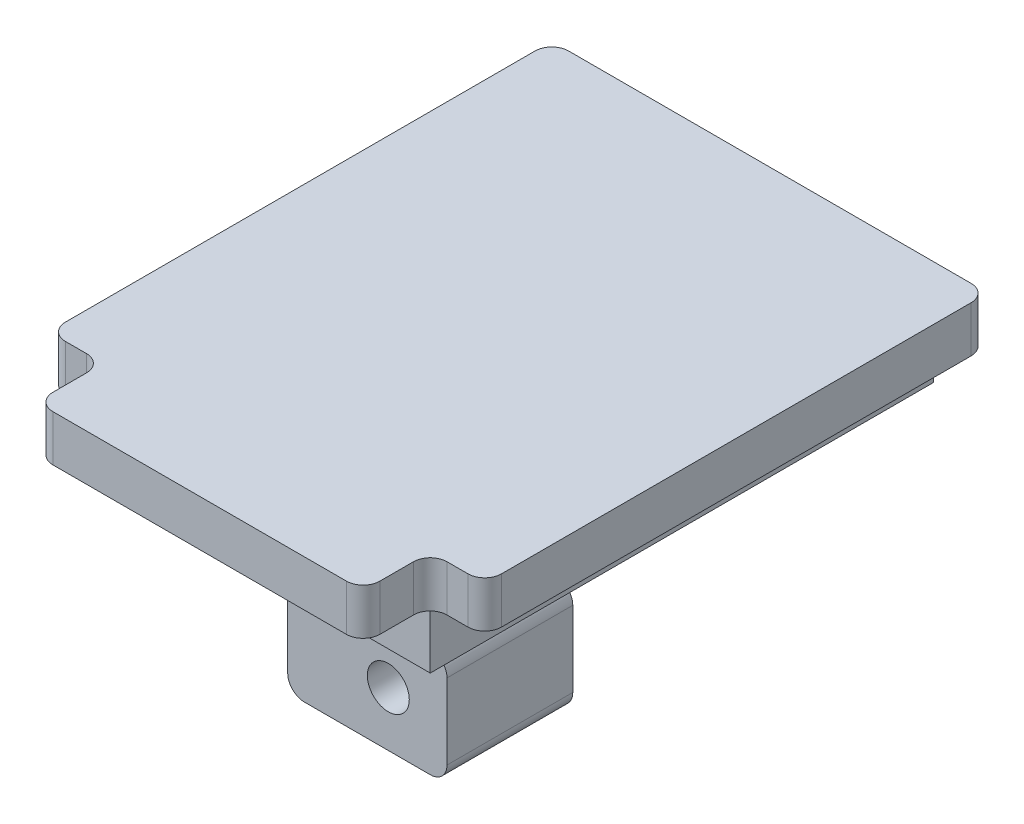
ISO-10303-21;
HEADER;
FILE_DESCRIPTION(('STEP AP214'),'2;1');
FILE_NAME('part.step','',(''),(''),'','','');
FILE_SCHEMA(('AUTOMOTIVE_DESIGN { 1 0 10303 214 1 1 1 1 }'));
ENDSEC;
DATA;
#1=APPLICATION_CONTEXT('core data for automotive mechanical design processes');
#2=APPLICATION_PROTOCOL_DEFINITION('international standard','automotive_design',2000,#1);
#3=PRODUCT_CONTEXT('',#1,'mechanical');
#4=PRODUCT('Part','Part','',(#3));
#5=PRODUCT_RELATED_PRODUCT_CATEGORY('part','',(#4));
#6=PRODUCT_DEFINITION_FORMATION('','',#4);
#7=PRODUCT_DEFINITION_CONTEXT('part definition',#1,'design');
#8=PRODUCT_DEFINITION('design','',#6,#7);
#9=PRODUCT_DEFINITION_SHAPE('','',#8);
#10=(LENGTH_UNIT() NAMED_UNIT(*) SI_UNIT(.MILLI.,.METRE.));
#11=(NAMED_UNIT(*) PLANE_ANGLE_UNIT() SI_UNIT($,.RADIAN.));
#12=(NAMED_UNIT(*) SI_UNIT($,.STERADIAN.) SOLID_ANGLE_UNIT());
#13=UNCERTAINTY_MEASURE_WITH_UNIT(LENGTH_MEASURE(1.E-05),#10,'distance_accuracy_value','');
#14=(GEOMETRIC_REPRESENTATION_CONTEXT(3) GLOBAL_UNCERTAINTY_ASSIGNED_CONTEXT((#13)) GLOBAL_UNIT_ASSIGNED_CONTEXT((#10,
#11,#12)) REPRESENTATION_CONTEXT('',''));
#15=CARTESIAN_POINT('',(0.,0.,0.));
#16=DIRECTION('',(0.,0.,1.));
#17=DIRECTION('',(1.,0.,0.));
#18=AXIS2_PLACEMENT_3D('',#15,#16,#17);
#19=CARTESIAN_POINT('',(19.5,-12.5,60.));
#20=DIRECTION('',(0.,1.,0.));
#21=DIRECTION('',(-1.,0.,0.));
#22=AXIS2_PLACEMENT_3D('',#19,#20,#21);
#23=PLANE('',#22);
#24=DIRECTION('',(1.,0.,0.));
#25=VECTOR('',#24,1.);
#26=CARTESIAN_POINT('',(19.5,-12.5,0.));
#27=LINE('',#26,#25);
#28=CARTESIAN_POINT('',(-19.5,-12.5,0.));
#29=VERTEX_POINT('',#28);
#30=CARTESIAN_POINT('',(19.5,-12.5,0.));
#31=VERTEX_POINT('',#30);
#32=EDGE_CURVE('E310',#29,#31,#27,.T.);
#33=ORIENTED_EDGE('',*,*,#32,.T.);
#34=DIRECTION('',(0.,0.,-1.));
#35=VECTOR('',#34,1.);
#36=CARTESIAN_POINT('',(19.5,-12.5,60.));
#37=LINE('',#36,#35);
#38=CARTESIAN_POINT('',(19.5,-12.5,60.));
#39=VERTEX_POINT('',#38);
#40=EDGE_CURVE('E323',#39,#31,#37,.T.);
#41=ORIENTED_EDGE('',*,*,#40,.F.);
#42=DIRECTION('',(1.,0.,0.));
#43=VECTOR('',#42,1.);
#44=CARTESIAN_POINT('',(19.5,-12.5,60.));
#45=LINE('',#44,#43);
#46=CARTESIAN_POINT('',(-19.5,-12.5,60.));
#47=VERTEX_POINT('',#46);
#48=EDGE_CURVE('E321',#47,#39,#45,.T.);
#49=ORIENTED_EDGE('',*,*,#48,.F.);
#50=DIRECTION('',(0.,0.,-1.));
#51=VECTOR('',#50,1.);
#52=CARTESIAN_POINT('',(-19.5,-12.5,60.));
#53=LINE('',#52,#51);
#54=EDGE_CURVE('E339',#47,#29,#53,.T.);
#55=ORIENTED_EDGE('',*,*,#54,.T.);
#56=EDGE_LOOP('',(#33,#41,#49,#55));
#57=FACE_BOUND('',#56,.T.);
#58=DIRECTION('',(0.,0.,1.));
#59=VECTOR('',#58,1.);
#60=CARTESIAN_POINT('',(3.,-12.5,45.5));
#61=LINE('',#60,#59);
#62=CARTESIAN_POINT('',(3.,-12.5,30.5));
#63=VERTEX_POINT('',#62);
#64=CARTESIAN_POINT('',(3.,-12.5,45.5));
#65=VERTEX_POINT('',#64);
#66=EDGE_CURVE('E274',#63,#65,#61,.T.);
#67=ORIENTED_EDGE('',*,*,#66,.F.);
#68=DIRECTION('',(1.,0.,0.));
#69=VECTOR('',#68,1.);
#70=CARTESIAN_POINT('',(-3.,-12.5,30.5));
#71=LINE('',#70,#69);
#72=CARTESIAN_POINT('',(-3.,-12.5,30.5));
#73=VERTEX_POINT('',#72);
#74=EDGE_CURVE('E269',#73,#63,#71,.T.);
#75=ORIENTED_EDGE('',*,*,#74,.F.);
#76=DIRECTION('',(0.,0.,-1.));
#77=VECTOR('',#76,1.);
#78=CARTESIAN_POINT('',(-3.,-12.5,45.5));
#79=LINE('',#78,#77);
#80=CARTESIAN_POINT('',(-3.,-12.5,45.5));
#81=VERTEX_POINT('',#80);
#82=EDGE_CURVE('E254',#81,#73,#79,.T.);
#83=ORIENTED_EDGE('',*,*,#82,.F.);
#84=DIRECTION('',(-1.,0.,0.));
#85=VECTOR('',#84,1.);
#86=CARTESIAN_POINT('',(-3.,-12.5,45.5));
#87=LINE('',#86,#85);
#88=EDGE_CURVE('E266',#65,#81,#87,.T.);
#89=ORIENTED_EDGE('',*,*,#88,.F.);
#90=EDGE_LOOP('',(#67,#75,#83,#89));
#91=FACE_BOUND('',#90,.T.);
#92=ADVANCED_FACE('F36',(#57,#91),#23,.F.);
#93=CARTESIAN_POINT('',(0.,0.,60.));
#94=DIRECTION('',(0.,0.,-1.));
#95=DIRECTION('',(-1.,0.,0.));
#96=AXIS2_PLACEMENT_3D('',#93,#94,#95);
#97=PLANE('',#96);
#98=DIRECTION('',(-1.,0.,0.));
#99=VECTOR('',#98,1.);
#100=CARTESIAN_POINT('',(-26.,0.,60.));
#101=LINE('',#100,#99);
#102=CARTESIAN_POINT('',(-21.5,0.,60.));
#103=VERTEX_POINT('',#102);
#104=CARTESIAN_POINT('',(-24.,0.,60.));
#105=VERTEX_POINT('',#104);
#106=EDGE_CURVE('E313',#103,#105,#101,.T.);
#107=ORIENTED_EDGE('',*,*,#106,.T.);
#108=DIRECTION('',(0.,-1.,0.));
#109=VECTOR('',#108,1.);
#110=CARTESIAN_POINT('',(-24.,0.,60.));
#111=LINE('',#110,#109);
#112=CARTESIAN_POINT('',(-24.,-5.5,60.));
#113=VERTEX_POINT('',#112);
#114=EDGE_CURVE('E396',#105,#113,#111,.T.);
#115=ORIENTED_EDGE('',*,*,#114,.T.);
#116=DIRECTION('',(1.,0.,0.));
#117=VECTOR('',#116,1.);
#118=CARTESIAN_POINT('',(-19.5,-5.5,60.));
#119=LINE('',#118,#117);
#120=CARTESIAN_POINT('',(-21.5,-5.5,60.));
#121=VERTEX_POINT('',#120);
#122=EDGE_CURVE('E317',#113,#121,#119,.T.);
#123=ORIENTED_EDGE('',*,*,#122,.T.);
#124=DIRECTION('',(0.,-1.,0.));
#125=VECTOR('',#124,1.);
#126=CARTESIAN_POINT('',(-21.5,0.,60.));
#127=LINE('',#126,#125);
#128=EDGE_CURVE('E394',#121,#103,#127,.F.);
#129=ORIENTED_EDGE('',*,*,#128,.T.);
#130=EDGE_LOOP('',(#107,#115,#123,#129));
#131=FACE_BOUND('',#130,.T.);
#132=ADVANCED_FACE('F562',(#131),#97,.F.);
#133=DIRECTION('',(1.,0.,0.));
#134=VECTOR('',#133,1.);
#135=CARTESIAN_POINT('',(26.,-5.49999999999999,60.));
#136=LINE('',#135,#134);
#137=CARTESIAN_POINT('',(21.5,-5.49999999999999,60.));
#138=VERTEX_POINT('',#137);
#139=CARTESIAN_POINT('',(24.,-5.49999999999999,60.));
#140=VERTEX_POINT('',#139);
#141=EDGE_CURVE('E309',#138,#140,#136,.T.);
#142=ORIENTED_EDGE('',*,*,#141,.T.);
#143=DIRECTION('',(0.,1.,0.));
#144=VECTOR('',#143,1.);
#145=CARTESIAN_POINT('',(24.,0.,60.));
#146=LINE('',#145,#144);
#147=CARTESIAN_POINT('',(24.,0.,60.));
#148=VERTEX_POINT('',#147);
#149=EDGE_CURVE('E401',#140,#148,#146,.T.);
#150=ORIENTED_EDGE('',*,*,#149,.T.);
#151=CARTESIAN_POINT('',(21.5,0.,60.));
#152=VERTEX_POINT('',#151);
#153=EDGE_CURVE('E314',#148,#152,#101,.T.);
#154=ORIENTED_EDGE('',*,*,#153,.T.);
#155=DIRECTION('',(0.,1.,0.));
#156=VECTOR('',#155,1.);
#157=CARTESIAN_POINT('',(21.5,-5.5,60.));
#158=LINE('',#157,#156);
#159=EDGE_CURVE('E399',#152,#138,#158,.F.);
#160=ORIENTED_EDGE('',*,*,#159,.T.);
#161=EDGE_LOOP('',(#142,#150,#154,#160));
#162=FACE_BOUND('',#161,.T.);
#163=ADVANCED_FACE('F568',(#162),#97,.F.);
#164=DIRECTION('',(1.,0.,0.));
#165=VECTOR('',#164,1.);
#166=CARTESIAN_POINT('',(-19.5,-5.5,60.));
#167=LINE('',#166,#165);
#168=CARTESIAN_POINT('',(-19.5,-5.5,60.));
#169=VERTEX_POINT('',#168);
#170=CARTESIAN_POINT('',(19.5,-5.5,60.));
#171=VERTEX_POINT('',#170);
#172=EDGE_CURVE('E285',#169,#171,#167,.T.);
#173=ORIENTED_EDGE('',*,*,#172,.F.);
#174=DIRECTION('',(0.,-1.,0.));
#175=VECTOR('',#174,1.);
#176=CARTESIAN_POINT('',(-19.5,-12.5,60.));
#177=LINE('',#176,#175);
#178=EDGE_CURVE('E319',#169,#47,#177,.T.);
#179=ORIENTED_EDGE('',*,*,#178,.T.);
#180=ORIENTED_EDGE('',*,*,#48,.T.);
#181=DIRECTION('',(0.,1.,0.));
#182=VECTOR('',#181,1.);
#183=CARTESIAN_POINT('',(19.5,-5.49999999999999,60.));
#184=LINE('',#183,#182);
#185=EDGE_CURVE('E306',#39,#171,#184,.T.);
#186=ORIENTED_EDGE('',*,*,#185,.T.);
#187=EDGE_LOOP('',(#173,#179,#180,#186));
#188=FACE_BOUND('',#187,.T.);
#189=ADVANCED_FACE('F571',(#188),#97,.F.);
#190=CARTESIAN_POINT('',(19.5,-5.49999999999999,60.));
#191=DIRECTION('',(-1.,0.,0.));
#192=DIRECTION('',(0.,-1.,0.));
#193=AXIS2_PLACEMENT_3D('',#190,#191,#192);
#194=PLANE('',#193);
#195=DIRECTION('',(0.,1.,0.));
#196=VECTOR('',#195,1.);
#197=CARTESIAN_POINT('',(19.5,-5.49999999999999,0.));
#198=LINE('',#197,#196);
#199=CARTESIAN_POINT('',(19.5,-5.49999999999999,0.));
#200=VERTEX_POINT('',#199);
#201=EDGE_CURVE('E305',#31,#200,#198,.T.);
#202=ORIENTED_EDGE('',*,*,#201,.T.);
#203=DIRECTION('',(0.,0.,-1.));
#204=VECTOR('',#203,1.);
#205=CARTESIAN_POINT('',(19.5,-5.49999999999999,60.));
#206=LINE('',#205,#204);
#207=EDGE_CURVE('E357',#171,#200,#206,.T.);
#208=ORIENTED_EDGE('',*,*,#207,.F.);
#209=ORIENTED_EDGE('',*,*,#185,.F.);
#210=ORIENTED_EDGE('',*,*,#40,.T.);
#211=EDGE_LOOP('',(#202,#208,#209,#210));
#212=FACE_BOUND('',#211,.T.);
#213=ADVANCED_FACE('F594',(#212),#194,.F.);
#214=CARTESIAN_POINT('',(26.,-5.49999999999999,60.));
#215=DIRECTION('',(0.,1.,0.));
#216=DIRECTION('',(-1.,0.,0.));
#217=AXIS2_PLACEMENT_3D('',#214,#215,#216);
#218=PLANE('',#217);
#219=DIRECTION('',(1.,0.,0.));
#220=VECTOR('',#219,1.);
#221=CARTESIAN_POINT('',(26.,-5.49999999999999,0.));
#222=LINE('',#221,#220);
#223=CARTESIAN_POINT('',(24.,-5.49999999999999,0.));
#224=VERTEX_POINT('',#223);
#225=EDGE_CURVE('E326',#200,#224,#222,.T.);
#226=ORIENTED_EDGE('',*,*,#225,.T.);
#227=CARTESIAN_POINT('',(24.,-5.49999999999999,2.));
#228=DIRECTION('',(0.,1.,0.));
#229=DIRECTION('',(-1.,0.,0.));
#230=AXIS2_PLACEMENT_3D('',#227,#228,#229);
#231=CIRCLE('',#230,2.);
#232=CARTESIAN_POINT('',(26.,-5.49999999999999,2.));
#233=VERTEX_POINT('',#232);
#234=EDGE_CURVE('E392',#224,#233,#231,.F.);
#235=ORIENTED_EDGE('',*,*,#234,.T.);
#236=DIRECTION('',(0.,0.,-1.));
#237=VECTOR('',#236,1.);
#238=CARTESIAN_POINT('',(26.,-5.49999999999999,60.));
#239=LINE('',#238,#237);
#240=CARTESIAN_POINT('',(26.,-5.49999999999999,58.));
#241=VERTEX_POINT('',#240);
#242=EDGE_CURVE('E354',#241,#233,#239,.T.);
#243=ORIENTED_EDGE('',*,*,#242,.F.);
#244=CARTESIAN_POINT('',(24.,-5.49999999999999,58.));
#245=DIRECTION('',(0.,1.,0.));
#246=DIRECTION('',(-1.,0.,0.));
#247=AXIS2_PLACEMENT_3D('',#244,#245,#246);
#248=CIRCLE('',#247,2.);
#249=EDGE_CURVE('E390',#241,#140,#248,.F.);
#250=ORIENTED_EDGE('',*,*,#249,.T.);
#251=ORIENTED_EDGE('',*,*,#141,.F.);
#252=CARTESIAN_POINT('',(21.5,-5.49999999999999,62.));
#253=DIRECTION('',(0.,1.,0.));
#254=DIRECTION('',(-1.,0.,0.));
#255=AXIS2_PLACEMENT_3D('',#252,#253,#254);
#256=CIRCLE('',#255,2.);
#257=CARTESIAN_POINT('',(19.5,-5.5,62.));
#258=VERTEX_POINT('',#257);
#259=EDGE_CURVE('E426',#138,#258,#256,.T.);
#260=ORIENTED_EDGE('',*,*,#259,.T.);
#261=DIRECTION('',(0.,0.,-1.));
#262=VECTOR('',#261,1.);
#263=CARTESIAN_POINT('',(19.5,-5.5,68.));
#264=LINE('',#263,#262);
#265=CARTESIAN_POINT('',(19.5,-5.5,66.));
#266=VERTEX_POINT('',#265);
#267=EDGE_CURVE('E300',#266,#258,#264,.T.);
#268=ORIENTED_EDGE('',*,*,#267,.F.);
#269=CARTESIAN_POINT('',(17.5,-5.5,66.));
#270=DIRECTION('',(0.,1.,0.));
#271=DIRECTION('',(0.,0.,1.));
#272=AXIS2_PLACEMENT_3D('',#269,#270,#271);
#273=CIRCLE('',#272,2.);
#274=CARTESIAN_POINT('',(17.5,-5.5,68.));
#275=VERTEX_POINT('',#274);
#276=EDGE_CURVE('E415',#266,#275,#273,.F.);
#277=ORIENTED_EDGE('',*,*,#276,.T.);
#278=DIRECTION('',(1.,0.,0.));
#279=VECTOR('',#278,1.);
#280=CARTESIAN_POINT('',(-19.5,-5.5,68.));
#281=LINE('',#280,#279);
#282=CARTESIAN_POINT('',(-17.5,-5.5,68.));
#283=VERTEX_POINT('',#282);
#284=EDGE_CURVE('E286',#283,#275,#281,.T.);
#285=ORIENTED_EDGE('',*,*,#284,.F.);
#286=CARTESIAN_POINT('',(-17.5,-5.5,66.));
#287=DIRECTION('',(0.,1.,0.));
#288=DIRECTION('',(0.,0.,1.));
#289=AXIS2_PLACEMENT_3D('',#286,#287,#288);
#290=CIRCLE('',#289,2.);
#291=CARTESIAN_POINT('',(-19.5,-5.5,66.));
#292=VERTEX_POINT('',#291);
#293=EDGE_CURVE('E417',#283,#292,#290,.F.);
#294=ORIENTED_EDGE('',*,*,#293,.T.);
#295=DIRECTION('',(0.,0.,-1.));
#296=VECTOR('',#295,1.);
#297=CARTESIAN_POINT('',(-19.5,-5.5,68.));
#298=LINE('',#297,#296);
#299=CARTESIAN_POINT('',(-19.5,-5.5,62.));
#300=VERTEX_POINT('',#299);
#301=EDGE_CURVE('E302',#292,#300,#298,.T.);
#302=ORIENTED_EDGE('',*,*,#301,.T.);
#303=CARTESIAN_POINT('',(-21.5,-5.5,62.));
#304=DIRECTION('',(0.,1.,0.));
#305=DIRECTION('',(0.,0.,1.));
#306=AXIS2_PLACEMENT_3D('',#303,#304,#305);
#307=CIRCLE('',#306,2.);
#308=EDGE_CURVE('E429',#300,#121,#307,.T.);
#309=ORIENTED_EDGE('',*,*,#308,.T.);
#310=ORIENTED_EDGE('',*,*,#122,.F.);
#311=CARTESIAN_POINT('',(-24.,-5.5,58.));
#312=DIRECTION('',(0.,1.,0.));
#313=DIRECTION('',(-1.,0.,0.));
#314=AXIS2_PLACEMENT_3D('',#311,#312,#313);
#315=CIRCLE('',#314,2.);
#316=CARTESIAN_POINT('',(-26.,-5.5,58.));
#317=VERTEX_POINT('',#316);
#318=EDGE_CURVE('E365',#113,#317,#315,.F.);
#319=ORIENTED_EDGE('',*,*,#318,.T.);
#320=DIRECTION('',(0.,0.,-1.));
#321=VECTOR('',#320,1.);
#322=CARTESIAN_POINT('',(-26.,-5.5,60.));
#323=LINE('',#322,#321);
#324=CARTESIAN_POINT('',(-26.,-5.5,2.));
#325=VERTEX_POINT('',#324);
#326=EDGE_CURVE('E345',#317,#325,#323,.T.);
#327=ORIENTED_EDGE('',*,*,#326,.T.);
#328=CARTESIAN_POINT('',(-24.,-5.5,2.));
#329=DIRECTION('',(0.,1.,0.));
#330=DIRECTION('',(-1.,0.,0.));
#331=AXIS2_PLACEMENT_3D('',#328,#329,#330);
#332=CIRCLE('',#331,2.);
#333=CARTESIAN_POINT('',(-24.,-5.5,0.));
#334=VERTEX_POINT('',#333);
#335=EDGE_CURVE('E367',#325,#334,#332,.F.);
#336=ORIENTED_EDGE('',*,*,#335,.T.);
#337=DIRECTION('',(1.,0.,0.));
#338=VECTOR('',#337,1.);
#339=CARTESIAN_POINT('',(-19.5,-5.5,0.));
#340=LINE('',#339,#338);
#341=CARTESIAN_POINT('',(-19.5,-5.5,0.));
#342=VERTEX_POINT('',#341);
#343=EDGE_CURVE('E332',#334,#342,#340,.T.);
#344=ORIENTED_EDGE('',*,*,#343,.T.);
#345=DIRECTION('',(0.,0.,-1.));
#346=VECTOR('',#345,1.);
#347=CARTESIAN_POINT('',(-19.5,-5.5,60.));
#348=LINE('',#347,#346);
#349=EDGE_CURVE('E342',#169,#342,#348,.T.);
#350=ORIENTED_EDGE('',*,*,#349,.F.);
#351=ORIENTED_EDGE('',*,*,#172,.T.);
#352=ORIENTED_EDGE('',*,*,#207,.T.);
#353=EDGE_LOOP('',(#226,#235,#243,#250,#251,#260,#268,#277,#285,#294,#302,#309,#310,#319,#327,
#336,#344,#350,#351,#352));
#354=FACE_BOUND('',#353,.T.);
#355=ADVANCED_FACE('F590',(#354),#218,.F.);
#356=CARTESIAN_POINT('',(26.,0.,60.));
#357=DIRECTION('',(-1.,0.,0.));
#358=DIRECTION('',(0.,0.,1.));
#359=AXIS2_PLACEMENT_3D('',#356,#357,#358);
#360=PLANE('',#359);
#361=ORIENTED_EDGE('',*,*,#242,.T.);
#362=DIRECTION('',(0.,1.,0.));
#363=VECTOR('',#362,1.);
#364=CARTESIAN_POINT('',(26.,0.,2.));
#365=LINE('',#364,#363);
#366=CARTESIAN_POINT('',(26.,0.,2.));
#367=VERTEX_POINT('',#366);
#368=EDGE_CURVE('E387',#233,#367,#365,.T.);
#369=ORIENTED_EDGE('',*,*,#368,.T.);
#370=DIRECTION('',(0.,0.,-1.));
#371=VECTOR('',#370,1.);
#372=CARTESIAN_POINT('',(26.,0.,60.));
#373=LINE('',#372,#371);
#374=CARTESIAN_POINT('',(26.,0.,58.));
#375=VERTEX_POINT('',#374);
#376=EDGE_CURVE('E351',#375,#367,#373,.T.);
#377=ORIENTED_EDGE('',*,*,#376,.F.);
#378=DIRECTION('',(0.,1.,0.));
#379=VECTOR('',#378,1.);
#380=CARTESIAN_POINT('',(26.,0.,58.));
#381=LINE('',#380,#379);
#382=EDGE_CURVE('E385',#375,#241,#381,.F.);
#383=ORIENTED_EDGE('',*,*,#382,.T.);
#384=EDGE_LOOP('',(#361,#369,#377,#383));
#385=FACE_BOUND('',#384,.T.);
#386=ADVANCED_FACE('F586',(#385),#360,.F.);
#387=CARTESIAN_POINT('',(-26.,0.,60.));
#388=DIRECTION('',(0.,-1.,0.));
#389=DIRECTION('',(1.,0.,0.));
#390=AXIS2_PLACEMENT_3D('',#387,#388,#389);
#391=PLANE('',#390);
#392=DIRECTION('',(-1.,0.,0.));
#393=VECTOR('',#392,1.);
#394=CARTESIAN_POINT('',(-26.,0.,0.));
#395=LINE('',#394,#393);
#396=CARTESIAN_POINT('',(24.,0.,0.));
#397=VERTEX_POINT('',#396);
#398=CARTESIAN_POINT('',(-24.,0.,0.));
#399=VERTEX_POINT('',#398);
#400=EDGE_CURVE('E329',#397,#399,#395,.T.);
#401=ORIENTED_EDGE('',*,*,#400,.T.);
#402=CARTESIAN_POINT('',(-24.,0.,2.));
#403=DIRECTION('',(0.,-1.,0.));
#404=DIRECTION('',(1.,0.,0.));
#405=AXIS2_PLACEMENT_3D('',#402,#403,#404);
#406=CIRCLE('',#405,2.);
#407=CARTESIAN_POINT('',(-26.,0.,2.));
#408=VERTEX_POINT('',#407);
#409=EDGE_CURVE('E383',#399,#408,#406,.F.);
#410=ORIENTED_EDGE('',*,*,#409,.T.);
#411=DIRECTION('',(0.,0.,-1.));
#412=VECTOR('',#411,1.);
#413=CARTESIAN_POINT('',(-26.,0.,60.));
#414=LINE('',#413,#412);
#415=CARTESIAN_POINT('',(-26.,0.,58.));
#416=VERTEX_POINT('',#415);
#417=EDGE_CURVE('E348',#416,#408,#414,.T.);
#418=ORIENTED_EDGE('',*,*,#417,.F.);
#419=CARTESIAN_POINT('',(-24.,0.,58.));
#420=DIRECTION('',(0.,-1.,0.));
#421=DIRECTION('',(1.,0.,0.));
#422=AXIS2_PLACEMENT_3D('',#419,#420,#421);
#423=CIRCLE('',#422,2.);
#424=EDGE_CURVE('E379',#416,#105,#423,.F.);
#425=ORIENTED_EDGE('',*,*,#424,.T.);
#426=ORIENTED_EDGE('',*,*,#106,.F.);
#427=CARTESIAN_POINT('',(-21.5,0.,62.));
#428=DIRECTION('',(0.,-1.,0.));
#429=DIRECTION('',(1.,0.,0.));
#430=AXIS2_PLACEMENT_3D('',#427,#428,#429);
#431=CIRCLE('',#430,2.);
#432=CARTESIAN_POINT('',(-19.5,0.,62.));
#433=VERTEX_POINT('',#432);
#434=EDGE_CURVE('E432',#103,#433,#431,.T.);
#435=ORIENTED_EDGE('',*,*,#434,.T.);
#436=DIRECTION('',(0.,0.,-1.));
#437=VECTOR('',#436,1.);
#438=CARTESIAN_POINT('',(-19.5,0.,68.));
#439=LINE('',#438,#437);
#440=CARTESIAN_POINT('',(-19.5,0.,66.));
#441=VERTEX_POINT('',#440);
#442=EDGE_CURVE('E292',#441,#433,#439,.T.);
#443=ORIENTED_EDGE('',*,*,#442,.F.);
#444=CARTESIAN_POINT('',(-17.5,0.,66.));
#445=DIRECTION('',(0.,-1.,0.));
#446=DIRECTION('',(1.,0.,0.));
#447=AXIS2_PLACEMENT_3D('',#444,#445,#446);
#448=CIRCLE('',#447,2.);
#449=CARTESIAN_POINT('',(-17.5,0.,68.));
#450=VERTEX_POINT('',#449);
#451=EDGE_CURVE('E375',#441,#450,#448,.F.);
#452=ORIENTED_EDGE('',*,*,#451,.T.);
#453=DIRECTION('',(-1.,0.,0.));
#454=VECTOR('',#453,1.);
#455=CARTESIAN_POINT('',(-19.5,0.,68.));
#456=LINE('',#455,#454);
#457=CARTESIAN_POINT('',(17.5,0.,68.));
#458=VERTEX_POINT('',#457);
#459=EDGE_CURVE('E289',#458,#450,#456,.T.);
#460=ORIENTED_EDGE('',*,*,#459,.F.);
#461=CARTESIAN_POINT('',(17.5,0.,66.));
#462=DIRECTION('',(0.,-1.,0.));
#463=DIRECTION('',(1.,0.,0.));
#464=AXIS2_PLACEMENT_3D('',#461,#462,#463);
#465=CIRCLE('',#464,2.);
#466=CARTESIAN_POINT('',(19.5,0.,66.));
#467=VERTEX_POINT('',#466);
#468=EDGE_CURVE('E373',#458,#467,#465,.F.);
#469=ORIENTED_EDGE('',*,*,#468,.T.);
#470=DIRECTION('',(0.,0.,-1.));
#471=VECTOR('',#470,1.);
#472=CARTESIAN_POINT('',(19.5,0.,68.));
#473=LINE('',#472,#471);
#474=CARTESIAN_POINT('',(19.5,0.,62.));
#475=VERTEX_POINT('',#474);
#476=EDGE_CURVE('E297',#467,#475,#473,.T.);
#477=ORIENTED_EDGE('',*,*,#476,.T.);
#478=CARTESIAN_POINT('',(21.5,0.,62.));
#479=DIRECTION('',(0.,-1.,0.));
#480=DIRECTION('',(1.,0.,0.));
#481=AXIS2_PLACEMENT_3D('',#478,#479,#480);
#482=CIRCLE('',#481,2.);
#483=EDGE_CURVE('E424',#475,#152,#482,.T.);
#484=ORIENTED_EDGE('',*,*,#483,.T.);
#485=ORIENTED_EDGE('',*,*,#153,.F.);
#486=CARTESIAN_POINT('',(24.,0.,58.));
#487=DIRECTION('',(0.,-1.,0.));
#488=DIRECTION('',(1.,0.,0.));
#489=AXIS2_PLACEMENT_3D('',#486,#487,#488);
#490=CIRCLE('',#489,2.);
#491=EDGE_CURVE('E377',#148,#375,#490,.F.);
#492=ORIENTED_EDGE('',*,*,#491,.T.);
#493=ORIENTED_EDGE('',*,*,#376,.T.);
#494=CARTESIAN_POINT('',(24.,0.,2.));
#495=DIRECTION('',(0.,-1.,0.));
#496=DIRECTION('',(1.,0.,0.));
#497=AXIS2_PLACEMENT_3D('',#494,#495,#496);
#498=CIRCLE('',#497,2.);
#499=EDGE_CURVE('E381',#367,#397,#498,.F.);
#500=ORIENTED_EDGE('',*,*,#499,.T.);
#501=EDGE_LOOP('',(#401,#410,#418,#425,#426,#435,#443,#452,#460,#469,#477,#484,#485,#492,#493,#500));
#502=FACE_BOUND('',#501,.T.);
#503=ADVANCED_FACE('F582',(#502),#391,.F.);
#504=CARTESIAN_POINT('',(-26.,-5.5,60.));
#505=DIRECTION('',(1.,0.,0.));
#506=DIRECTION('',(0.,0.,-1.));
#507=AXIS2_PLACEMENT_3D('',#504,#505,#506);
#508=PLANE('',#507);
#509=ORIENTED_EDGE('',*,*,#417,.T.);
#510=DIRECTION('',(0.,-1.,0.));
#511=VECTOR('',#510,1.);
#512=CARTESIAN_POINT('',(-26.,-5.5,2.));
#513=LINE('',#512,#511);
#514=EDGE_CURVE('E362',#408,#325,#513,.T.);
#515=ORIENTED_EDGE('',*,*,#514,.T.);
#516=ORIENTED_EDGE('',*,*,#326,.F.);
#517=DIRECTION('',(0.,-1.,0.));
#518=VECTOR('',#517,1.);
#519=CARTESIAN_POINT('',(-26.,-5.5,58.));
#520=LINE('',#519,#518);
#521=EDGE_CURVE('E360',#317,#416,#520,.F.);
#522=ORIENTED_EDGE('',*,*,#521,.T.);
#523=EDGE_LOOP('',(#509,#515,#516,#522));
#524=FACE_BOUND('',#523,.T.);
#525=ADVANCED_FACE('F578',(#524),#508,.F.);
#526=CARTESIAN_POINT('',(-19.5,-12.5,60.));
#527=DIRECTION('',(1.,0.,0.));
#528=DIRECTION('',(0.,1.,0.));
#529=AXIS2_PLACEMENT_3D('',#526,#527,#528);
#530=PLANE('',#529);
#531=DIRECTION('',(0.,-1.,0.));
#532=VECTOR('',#531,1.);
#533=CARTESIAN_POINT('',(-19.5,-12.5,0.));
#534=LINE('',#533,#532);
#535=EDGE_CURVE('E334',#342,#29,#534,.T.);
#536=ORIENTED_EDGE('',*,*,#535,.T.);
#537=ORIENTED_EDGE('',*,*,#54,.F.);
#538=ORIENTED_EDGE('',*,*,#178,.F.);
#539=ORIENTED_EDGE('',*,*,#349,.T.);
#540=EDGE_LOOP('',(#536,#537,#538,#539));
#541=FACE_BOUND('',#540,.T.);
#542=ADVANCED_FACE('F575',(#541),#530,.F.);
#543=CARTESIAN_POINT('',(0.,0.,0.));
#544=DIRECTION('',(0.,0.,-1.));
#545=DIRECTION('',(-1.,0.,0.));
#546=AXIS2_PLACEMENT_3D('',#543,#544,#545);
#547=PLANE('',#546);
#548=ORIENTED_EDGE('',*,*,#343,.F.);
#549=DIRECTION('',(0.,-1.,0.));
#550=VECTOR('',#549,1.);
#551=CARTESIAN_POINT('',(-24.,0.,0.));
#552=LINE('',#551,#550);
#553=EDGE_CURVE('E371',#334,#399,#552,.F.);
#554=ORIENTED_EDGE('',*,*,#553,.T.);
#555=ORIENTED_EDGE('',*,*,#400,.F.);
#556=DIRECTION('',(0.,1.,0.));
#557=VECTOR('',#556,1.);
#558=CARTESIAN_POINT('',(24.,-5.49999999999999,0.));
#559=LINE('',#558,#557);
#560=EDGE_CURVE('E369',#397,#224,#559,.F.);
#561=ORIENTED_EDGE('',*,*,#560,.T.);
#562=ORIENTED_EDGE('',*,*,#225,.F.);
#563=ORIENTED_EDGE('',*,*,#201,.F.);
#564=ORIENTED_EDGE('',*,*,#32,.F.);
#565=ORIENTED_EDGE('',*,*,#535,.F.);
#566=EDGE_LOOP('',(#548,#554,#555,#561,#562,#563,#564,#565));
#567=FACE_BOUND('',#566,.T.);
#568=ADVANCED_FACE('F574',(#567),#547,.T.);
#569=CARTESIAN_POINT('',(-19.5,-5.5,68.));
#570=DIRECTION('',(1.,0.,0.));
#571=DIRECTION('',(0.,0.,-1.));
#572=AXIS2_PLACEMENT_3D('',#569,#570,#571);
#573=PLANE('',#572);
#574=ORIENTED_EDGE('',*,*,#301,.F.);
#575=DIRECTION('',(0.,-1.,0.));
#576=VECTOR('',#575,1.);
#577=CARTESIAN_POINT('',(-19.5,-5.5,66.));
#578=LINE('',#577,#576);
#579=EDGE_CURVE('E422',#292,#441,#578,.F.);
#580=ORIENTED_EDGE('',*,*,#579,.T.);
#581=ORIENTED_EDGE('',*,*,#442,.T.);
#582=DIRECTION('',(0.,-1.,0.));
#583=VECTOR('',#582,1.);
#584=CARTESIAN_POINT('',(-19.5,-5.5,62.));
#585=LINE('',#584,#583);
#586=EDGE_CURVE('E419',#433,#300,#585,.T.);
#587=ORIENTED_EDGE('',*,*,#586,.T.);
#588=EDGE_LOOP('',(#574,#580,#581,#587));
#589=FACE_BOUND('',#588,.T.);
#590=ADVANCED_FACE('F814',(#589),#573,.F.);
#591=CARTESIAN_POINT('',(19.5,-5.5,68.));
#592=DIRECTION('',(-1.,0.,0.));
#593=DIRECTION('',(0.,0.,1.));
#594=AXIS2_PLACEMENT_3D('',#591,#592,#593);
#595=PLANE('',#594);
#596=ORIENTED_EDGE('',*,*,#267,.T.);
#597=DIRECTION('',(0.,1.,0.));
#598=VECTOR('',#597,1.);
#599=CARTESIAN_POINT('',(19.5,0.,62.));
#600=LINE('',#599,#598);
#601=EDGE_CURVE('E406',#258,#475,#600,.T.);
#602=ORIENTED_EDGE('',*,*,#601,.T.);
#603=ORIENTED_EDGE('',*,*,#476,.F.);
#604=DIRECTION('',(0.,1.,0.));
#605=VECTOR('',#604,1.);
#606=CARTESIAN_POINT('',(19.5,-5.5,66.));
#607=LINE('',#606,#605);
#608=EDGE_CURVE('E404',#467,#266,#607,.F.);
#609=ORIENTED_EDGE('',*,*,#608,.T.);
#610=EDGE_LOOP('',(#596,#602,#603,#609));
#611=FACE_BOUND('',#610,.T.);
#612=ADVANCED_FACE('F803',(#611),#595,.F.);
#613=CARTESIAN_POINT('',(0.,0.,68.));
#614=DIRECTION('',(0.,0.,-1.));
#615=DIRECTION('',(-1.,0.,0.));
#616=AXIS2_PLACEMENT_3D('',#613,#614,#615);
#617=PLANE('',#616);
#618=ORIENTED_EDGE('',*,*,#459,.T.);
#619=DIRECTION('',(0.,-1.,0.));
#620=VECTOR('',#619,1.);
#621=CARTESIAN_POINT('',(-17.5,0.,68.));
#622=LINE('',#621,#620);
#623=EDGE_CURVE('E412',#450,#283,#622,.T.);
#624=ORIENTED_EDGE('',*,*,#623,.T.);
#625=ORIENTED_EDGE('',*,*,#284,.T.);
#626=DIRECTION('',(0.,1.,0.));
#627=VECTOR('',#626,1.);
#628=CARTESIAN_POINT('',(17.5,0.,68.));
#629=LINE('',#628,#627);
#630=EDGE_CURVE('E409',#275,#458,#629,.T.);
#631=ORIENTED_EDGE('',*,*,#630,.T.);
#632=EDGE_LOOP('',(#618,#624,#625,#631));
#633=FACE_BOUND('',#632,.T.);
#634=ADVANCED_FACE('F603',(#633),#617,.F.);
#635=CARTESIAN_POINT('',(-24.,-5.5,2.));
#636=DIRECTION('',(0.,1.,0.));
#637=DIRECTION('',(0.,0.,1.));
#638=AXIS2_PLACEMENT_3D('',#635,#636,#637);
#639=CYLINDRICAL_SURFACE('',#638,2.);
#640=ORIENTED_EDGE('',*,*,#409,.F.);
#641=ORIENTED_EDGE('',*,*,#553,.F.);
#642=ORIENTED_EDGE('',*,*,#335,.F.);
#643=ORIENTED_EDGE('',*,*,#514,.F.);
#644=EDGE_LOOP('',(#640,#641,#642,#643));
#645=FACE_BOUND('',#644,.T.);
#646=ADVANCED_FACE('F599',(#645),#639,.T.);
#647=CARTESIAN_POINT('',(24.,0.,2.));
#648=DIRECTION('',(0.,-1.,0.));
#649=DIRECTION('',(0.,0.,-1.));
#650=AXIS2_PLACEMENT_3D('',#647,#648,#649);
#651=CYLINDRICAL_SURFACE('',#650,2.);
#652=ORIENTED_EDGE('',*,*,#234,.F.);
#653=ORIENTED_EDGE('',*,*,#560,.F.);
#654=ORIENTED_EDGE('',*,*,#499,.F.);
#655=ORIENTED_EDGE('',*,*,#368,.F.);
#656=EDGE_LOOP('',(#652,#653,#654,#655));
#657=FACE_BOUND('',#656,.T.);
#658=ADVANCED_FACE('F602',(#657),#651,.T.);
#659=CARTESIAN_POINT('',(-24.,0.,58.));
#660=DIRECTION('',(0.,-1.,0.));
#661=DIRECTION('',(0.,0.,-1.));
#662=AXIS2_PLACEMENT_3D('',#659,#660,#661);
#663=CYLINDRICAL_SURFACE('',#662,2.);
#664=ORIENTED_EDGE('',*,*,#424,.F.);
#665=ORIENTED_EDGE('',*,*,#521,.F.);
#666=ORIENTED_EDGE('',*,*,#318,.F.);
#667=ORIENTED_EDGE('',*,*,#114,.F.);
#668=EDGE_LOOP('',(#664,#665,#666,#667));
#669=FACE_BOUND('',#668,.T.);
#670=ADVANCED_FACE('F607',(#669),#663,.T.);
#671=CARTESIAN_POINT('',(24.,0.,58.));
#672=DIRECTION('',(0.,1.,0.));
#673=DIRECTION('',(0.,0.,1.));
#674=AXIS2_PLACEMENT_3D('',#671,#672,#673);
#675=CYLINDRICAL_SURFACE('',#674,2.);
#676=ORIENTED_EDGE('',*,*,#249,.F.);
#677=ORIENTED_EDGE('',*,*,#382,.F.);
#678=ORIENTED_EDGE('',*,*,#491,.F.);
#679=ORIENTED_EDGE('',*,*,#149,.F.);
#680=EDGE_LOOP('',(#676,#677,#678,#679));
#681=FACE_BOUND('',#680,.T.);
#682=ADVANCED_FACE('F611',(#681),#675,.T.);
#683=CARTESIAN_POINT('',(21.5,-5.5,62.));
#684=DIRECTION('',(0.,-1.,0.));
#685=DIRECTION('',(0.,0.,-1.));
#686=AXIS2_PLACEMENT_3D('',#683,#684,#685);
#687=CYLINDRICAL_SURFACE('',#686,2.);
#688=ORIENTED_EDGE('',*,*,#259,.F.);
#689=ORIENTED_EDGE('',*,*,#159,.F.);
#690=ORIENTED_EDGE('',*,*,#483,.F.);
#691=ORIENTED_EDGE('',*,*,#601,.F.);
#692=EDGE_LOOP('',(#688,#689,#690,#691));
#693=FACE_BOUND('',#692,.T.);
#694=ADVANCED_FACE('F615',(#693),#687,.F.);
#695=CARTESIAN_POINT('',(-17.5,0.,66.));
#696=DIRECTION('',(0.,-1.,0.));
#697=DIRECTION('',(0.,0.,-1.));
#698=AXIS2_PLACEMENT_3D('',#695,#696,#697);
#699=CYLINDRICAL_SURFACE('',#698,2.);
#700=ORIENTED_EDGE('',*,*,#451,.F.);
#701=ORIENTED_EDGE('',*,*,#579,.F.);
#702=ORIENTED_EDGE('',*,*,#293,.F.);
#703=ORIENTED_EDGE('',*,*,#623,.F.);
#704=EDGE_LOOP('',(#700,#701,#702,#703));
#705=FACE_BOUND('',#704,.T.);
#706=ADVANCED_FACE('F619',(#705),#699,.T.);
#707=CARTESIAN_POINT('',(17.5,0.,66.));
#708=DIRECTION('',(0.,1.,0.));
#709=DIRECTION('',(0.,0.,1.));
#710=AXIS2_PLACEMENT_3D('',#707,#708,#709);
#711=CYLINDRICAL_SURFACE('',#710,2.);
#712=ORIENTED_EDGE('',*,*,#276,.F.);
#713=ORIENTED_EDGE('',*,*,#608,.F.);
#714=ORIENTED_EDGE('',*,*,#468,.F.);
#715=ORIENTED_EDGE('',*,*,#630,.F.);
#716=EDGE_LOOP('',(#712,#713,#714,#715));
#717=FACE_BOUND('',#716,.T.);
#718=ADVANCED_FACE('F623',(#717),#711,.T.);
#719=CARTESIAN_POINT('',(-21.5,-5.5,62.));
#720=DIRECTION('',(0.,1.,0.));
#721=DIRECTION('',(0.,0.,1.));
#722=AXIS2_PLACEMENT_3D('',#719,#720,#721);
#723=CYLINDRICAL_SURFACE('',#722,2.);
#724=ORIENTED_EDGE('',*,*,#434,.F.);
#725=ORIENTED_EDGE('',*,*,#128,.F.);
#726=ORIENTED_EDGE('',*,*,#308,.F.);
#727=ORIENTED_EDGE('',*,*,#586,.F.);
#728=EDGE_LOOP('',(#724,#725,#726,#727));
#729=FACE_BOUND('',#728,.T.);
#730=ADVANCED_FACE('F627',(#729),#723,.F.);
#731=CARTESIAN_POINT('',(3.,-24.5,45.5));
#732=DIRECTION('',(-1.,0.,0.));
#733=DIRECTION('',(0.,0.,1.));
#734=AXIS2_PLACEMENT_3D('',#731,#732,#733);
#735=PLANE('',#734);
#736=DIRECTION('',(0.,1.,0.));
#737=VECTOR('',#736,1.);
#738=CARTESIAN_POINT('',(3.,-24.5,45.5));
#739=LINE('',#738,#737);
#740=CARTESIAN_POINT('',(3.,-22.5,45.5));
#741=VERTEX_POINT('',#740);
#742=EDGE_CURVE('E259',#741,#65,#739,.T.);
#743=ORIENTED_EDGE('',*,*,#742,.F.);
#744=DIRECTION('',(0.,0.,1.));
#745=VECTOR('',#744,1.);
#746=CARTESIAN_POINT('',(3.,-22.5,30.5));
#747=LINE('',#746,#745);
#748=CARTESIAN_POINT('',(3.,-22.5,30.5));
#749=VERTEX_POINT('',#748);
#750=EDGE_CURVE('E434',#741,#749,#747,.F.);
#751=ORIENTED_EDGE('',*,*,#750,.T.);
#752=DIRECTION('',(0.,1.,0.));
#753=VECTOR('',#752,1.);
#754=CARTESIAN_POINT('',(3.,-24.5,30.5));
#755=LINE('',#754,#753);
#756=EDGE_CURVE('E281',#749,#63,#755,.T.);
#757=ORIENTED_EDGE('',*,*,#756,.T.);
#758=ORIENTED_EDGE('',*,*,#66,.T.);
#759=EDGE_LOOP('',(#743,#751,#757,#758));
#760=FACE_BOUND('',#759,.T.);
#761=ADVANCED_FACE('F522',(#760),#735,.F.);
#762=CARTESIAN_POINT('',(-3.,-24.5,45.5));
#763=DIRECTION('',(0.,0.,-1.));
#764=DIRECTION('',(-1.,0.,0.));
#765=AXIS2_PLACEMENT_3D('',#762,#763,#764);
#766=PLANE('',#765);
#767=CARTESIAN_POINT('',(0.,-31.,45.5));
#768=DIRECTION('',(0.,0.,1.));
#769=DIRECTION('',(1.,0.,0.));
#770=AXIS2_PLACEMENT_3D('',#767,#768,#769);
#771=CIRCLE('',#770,2.5);
#772=CARTESIAN_POINT('',(2.5,-31.,45.5));
#773=VERTEX_POINT('',#772);
#774=EDGE_CURVE('E487',#773,#773,#771,.T.);
#775=ORIENTED_EDGE('',*,*,#774,.F.);
#776=EDGE_LOOP('',(#775));
#777=FACE_BOUND('',#776,.T.);
#778=DIRECTION('',(0.,1.,0.));
#779=VECTOR('',#778,1.);
#780=CARTESIAN_POINT('',(7.,-37.5,45.5));
#781=LINE('',#780,#779);
#782=CARTESIAN_POINT('',(7.,-35.5,45.5));
#783=VERTEX_POINT('',#782);
#784=CARTESIAN_POINT('',(7.,-26.5,45.5));
#785=VERTEX_POINT('',#784);
#786=EDGE_CURVE('E276',#783,#785,#781,.T.);
#787=ORIENTED_EDGE('',*,*,#786,.T.);
#788=CARTESIAN_POINT('',(5.,-26.5,45.5));
#789=DIRECTION('',(0.,0.,-1.));
#790=DIRECTION('',(-1.,0.,0.));
#791=AXIS2_PLACEMENT_3D('',#788,#789,#790);
#792=CIRCLE('',#791,2.);
#793=CARTESIAN_POINT('',(5.,-24.5,45.5));
#794=VERTEX_POINT('',#793);
#795=EDGE_CURVE('E447',#785,#794,#792,.F.);
#796=ORIENTED_EDGE('',*,*,#795,.T.);
#797=CARTESIAN_POINT('',(5.,-22.5,45.5));
#798=DIRECTION('',(0.,0.,-1.));
#799=DIRECTION('',(-1.,0.,0.));
#800=AXIS2_PLACEMENT_3D('',#797,#798,#799);
#801=CIRCLE('',#800,2.);
#802=EDGE_CURVE('E473',#794,#741,#801,.T.);
#803=ORIENTED_EDGE('',*,*,#802,.T.);
#804=ORIENTED_EDGE('',*,*,#742,.T.);
#805=ORIENTED_EDGE('',*,*,#88,.T.);
#806=DIRECTION('',(0.,1.,0.));
#807=VECTOR('',#806,1.);
#808=CARTESIAN_POINT('',(-3.,-24.5,45.5));
#809=LINE('',#808,#807);
#810=CARTESIAN_POINT('',(-3.,-22.5,45.5));
#811=VERTEX_POINT('',#810);
#812=EDGE_CURVE('E251',#811,#81,#809,.T.);
#813=ORIENTED_EDGE('',*,*,#812,.F.);
#814=CARTESIAN_POINT('',(-5.,-22.5,45.5));
#815=DIRECTION('',(0.,0.,-1.));
#816=DIRECTION('',(-1.,0.,0.));
#817=AXIS2_PLACEMENT_3D('',#814,#815,#816);
#818=CIRCLE('',#817,2.);
#819=CARTESIAN_POINT('',(-5.,-24.5,45.5));
#820=VERTEX_POINT('',#819);
#821=EDGE_CURVE('E11',#811,#820,#818,.T.);
#822=ORIENTED_EDGE('',*,*,#821,.T.);
#823=DIRECTION('',(-1.,0.,0.));
#824=VECTOR('',#823,1.);
#825=CARTESIAN_POINT('',(-12.,-24.5,45.5));
#826=LINE('',#825,#824);
#827=CARTESIAN_POINT('',(-10.,-24.5,45.5));
#828=VERTEX_POINT('',#827);
#829=EDGE_CURVE('E479',#820,#828,#826,.T.);
#830=ORIENTED_EDGE('',*,*,#829,.T.);
#831=CARTESIAN_POINT('',(-10.,-26.5,45.5));
#832=DIRECTION('',(0.,0.,-1.));
#833=DIRECTION('',(-1.,0.,0.));
#834=AXIS2_PLACEMENT_3D('',#831,#832,#833);
#835=CIRCLE('',#834,2.);
#836=CARTESIAN_POINT('',(-12.,-26.5,45.5));
#837=VERTEX_POINT('',#836);
#838=EDGE_CURVE('E441',#828,#837,#835,.F.);
#839=ORIENTED_EDGE('',*,*,#838,.T.);
#840=DIRECTION('',(0.,1.,0.));
#841=VECTOR('',#840,1.);
#842=CARTESIAN_POINT('',(-12.,-37.5,45.5));
#843=LINE('',#842,#841);
#844=CARTESIAN_POINT('',(-12.,-35.5,45.5));
#845=VERTEX_POINT('',#844);
#846=EDGE_CURVE('E508',#845,#837,#843,.T.);
#847=ORIENTED_EDGE('',*,*,#846,.F.);
#848=CARTESIAN_POINT('',(-10.,-35.5,45.5));
#849=DIRECTION('',(0.,0.,-1.));
#850=DIRECTION('',(-1.,0.,0.));
#851=AXIS2_PLACEMENT_3D('',#848,#849,#850);
#852=CIRCLE('',#851,2.);
#853=CARTESIAN_POINT('',(-10.,-37.5,45.5));
#854=VERTEX_POINT('',#853);
#855=EDGE_CURVE('E443',#845,#854,#852,.F.);
#856=ORIENTED_EDGE('',*,*,#855,.T.);
#857=DIRECTION('',(-1.,0.,0.));
#858=VECTOR('',#857,1.);
#859=CARTESIAN_POINT('',(-12.,-37.5,45.5));
#860=LINE('',#859,#858);
#861=CARTESIAN_POINT('',(5.,-37.5,45.5));
#862=VERTEX_POINT('',#861);
#863=EDGE_CURVE('E495',#862,#854,#860,.T.);
#864=ORIENTED_EDGE('',*,*,#863,.F.);
#865=CARTESIAN_POINT('',(5.,-35.5,45.5));
#866=DIRECTION('',(0.,0.,-1.));
#867=DIRECTION('',(-1.,0.,0.));
#868=AXIS2_PLACEMENT_3D('',#865,#866,#867);
#869=CIRCLE('',#868,2.);
#870=EDGE_CURVE('E445',#862,#783,#869,.F.);
#871=ORIENTED_EDGE('',*,*,#870,.T.);
#872=EDGE_LOOP('',(#787,#796,#803,#804,#805,#813,#822,#830,#839,#847,#856,#864,#871));
#873=FACE_BOUND('',#872,.T.);
#874=ADVANCED_FACE('F272',(#777,#873),#766,.F.);
#875=CARTESIAN_POINT('',(-3.,-24.5,45.5));
#876=DIRECTION('',(1.,0.,0.));
#877=DIRECTION('',(0.,1.,0.));
#878=AXIS2_PLACEMENT_3D('',#875,#876,#877);
#879=PLANE('',#878);
#880=DIRECTION('',(0.,1.,0.));
#881=VECTOR('',#880,1.);
#882=CARTESIAN_POINT('',(-3.,-24.5,30.5));
#883=LINE('',#882,#881);
#884=CARTESIAN_POINT('',(-3.,-22.5,30.5));
#885=VERTEX_POINT('',#884);
#886=EDGE_CURVE('E260',#885,#73,#883,.T.);
#887=ORIENTED_EDGE('',*,*,#886,.F.);
#888=DIRECTION('',(0.,0.,-1.));
#889=VECTOR('',#888,1.);
#890=CARTESIAN_POINT('',(-3.,-22.5,45.5));
#891=LINE('',#890,#889);
#892=EDGE_CURVE('E255',#885,#811,#891,.F.);
#893=ORIENTED_EDGE('',*,*,#892,.T.);
#894=ORIENTED_EDGE('',*,*,#812,.T.);
#895=ORIENTED_EDGE('',*,*,#82,.T.);
#896=EDGE_LOOP('',(#887,#893,#894,#895));
#897=FACE_BOUND('',#896,.T.);
#898=ADVANCED_FACE('F253',(#897),#879,.F.);
#899=CARTESIAN_POINT('',(-3.,-24.5,30.5));
#900=DIRECTION('',(0.,0.,1.));
#901=DIRECTION('',(1.,0.,0.));
#902=AXIS2_PLACEMENT_3D('',#899,#900,#901);
#903=PLANE('',#902);
#904=CARTESIAN_POINT('',(0.,-31.,30.5));
#905=DIRECTION('',(0.,0.,1.));
#906=DIRECTION('',(1.,0.,0.));
#907=AXIS2_PLACEMENT_3D('',#904,#905,#906);
#908=CIRCLE('',#907,2.5);
#909=CARTESIAN_POINT('',(2.5,-31.,30.5));
#910=VERTEX_POINT('',#909);
#911=EDGE_CURVE('E40',#910,#910,#908,.T.);
#912=ORIENTED_EDGE('',*,*,#911,.T.);
#913=EDGE_LOOP('',(#912));
#914=FACE_BOUND('',#913,.T.);
#915=ORIENTED_EDGE('',*,*,#756,.F.);
#916=CARTESIAN_POINT('',(5.,-22.5,30.5));
#917=DIRECTION('',(0.,0.,1.));
#918=DIRECTION('',(1.,0.,0.));
#919=AXIS2_PLACEMENT_3D('',#916,#917,#918);
#920=CIRCLE('',#919,2.);
#921=CARTESIAN_POINT('',(5.,-24.5,30.5));
#922=VERTEX_POINT('',#921);
#923=EDGE_CURVE('E475',#749,#922,#920,.T.);
#924=ORIENTED_EDGE('',*,*,#923,.T.);
#925=CARTESIAN_POINT('',(5.,-26.5,30.5));
#926=DIRECTION('',(0.,0.,1.));
#927=DIRECTION('',(1.,0.,0.));
#928=AXIS2_PLACEMENT_3D('',#925,#926,#927);
#929=CIRCLE('',#928,2.);
#930=CARTESIAN_POINT('',(7.,-26.5,30.5));
#931=VERTEX_POINT('',#930);
#932=EDGE_CURVE('E455',#922,#931,#929,.F.);
#933=ORIENTED_EDGE('',*,*,#932,.T.);
#934=DIRECTION('',(0.,1.,0.));
#935=VECTOR('',#934,1.);
#936=CARTESIAN_POINT('',(7.,-37.5,30.5));
#937=LINE('',#936,#935);
#938=CARTESIAN_POINT('',(7.,-35.5,30.5));
#939=VERTEX_POINT('',#938);
#940=EDGE_CURVE('E500',#939,#931,#937,.T.);
#941=ORIENTED_EDGE('',*,*,#940,.F.);
#942=CARTESIAN_POINT('',(5.,-35.5,30.5));
#943=DIRECTION('',(0.,0.,1.));
#944=DIRECTION('',(1.,0.,0.));
#945=AXIS2_PLACEMENT_3D('',#942,#943,#944);
#946=CIRCLE('',#945,2.);
#947=CARTESIAN_POINT('',(5.,-37.5,30.5));
#948=VERTEX_POINT('',#947);
#949=EDGE_CURVE('E453',#939,#948,#946,.F.);
#950=ORIENTED_EDGE('',*,*,#949,.T.);
#951=DIRECTION('',(1.,0.,0.));
#952=VECTOR('',#951,1.);
#953=CARTESIAN_POINT('',(-12.,-37.5,30.5));
#954=LINE('',#953,#952);
#955=CARTESIAN_POINT('',(-10.,-37.5,30.5));
#956=VERTEX_POINT('',#955);
#957=EDGE_CURVE('E498',#956,#948,#954,.T.);
#958=ORIENTED_EDGE('',*,*,#957,.F.);
#959=CARTESIAN_POINT('',(-10.,-35.5,30.5));
#960=DIRECTION('',(0.,0.,1.));
#961=DIRECTION('',(1.,0.,0.));
#962=AXIS2_PLACEMENT_3D('',#959,#960,#961);
#963=CIRCLE('',#962,2.);
#964=CARTESIAN_POINT('',(-12.,-35.5,30.5));
#965=VERTEX_POINT('',#964);
#966=EDGE_CURVE('E451',#956,#965,#963,.F.);
#967=ORIENTED_EDGE('',*,*,#966,.T.);
#968=DIRECTION('',(0.,1.,0.));
#969=VECTOR('',#968,1.);
#970=CARTESIAN_POINT('',(-12.,-37.5,30.5));
#971=LINE('',#970,#969);
#972=CARTESIAN_POINT('',(-12.,-26.5,30.5));
#973=VERTEX_POINT('',#972);
#974=EDGE_CURVE('E505',#965,#973,#971,.T.);
#975=ORIENTED_EDGE('',*,*,#974,.T.);
#976=CARTESIAN_POINT('',(-10.,-26.5,30.5));
#977=DIRECTION('',(0.,0.,1.));
#978=DIRECTION('',(1.,0.,0.));
#979=AXIS2_PLACEMENT_3D('',#976,#977,#978);
#980=CIRCLE('',#979,2.);
#981=CARTESIAN_POINT('',(-10.,-24.5,30.5));
#982=VERTEX_POINT('',#981);
#983=EDGE_CURVE('E449',#973,#982,#980,.F.);
#984=ORIENTED_EDGE('',*,*,#983,.T.);
#985=DIRECTION('',(1.,0.,0.));
#986=VECTOR('',#985,1.);
#987=CARTESIAN_POINT('',(-12.,-24.5,30.5));
#988=LINE('',#987,#986);
#989=CARTESIAN_POINT('',(-5.,-24.5,30.5));
#990=VERTEX_POINT('',#989);
#991=EDGE_CURVE('E484',#982,#990,#988,.T.);
#992=ORIENTED_EDGE('',*,*,#991,.T.);
#993=CARTESIAN_POINT('',(-5.,-22.5,30.5));
#994=DIRECTION('',(0.,0.,1.));
#995=DIRECTION('',(1.,0.,0.));
#996=AXIS2_PLACEMENT_3D('',#993,#994,#995);
#997=CIRCLE('',#996,2.);
#998=EDGE_CURVE('E45',#990,#885,#997,.T.);
#999=ORIENTED_EDGE('',*,*,#998,.T.);
#1000=ORIENTED_EDGE('',*,*,#886,.T.);
#1001=ORIENTED_EDGE('',*,*,#74,.T.);
#1002=EDGE_LOOP('',(#915,#924,#933,#941,#950,#958,#967,#975,#984,#992,#999,#1000,#1001));
#1003=FACE_BOUND('',#1002,.T.);
#1004=ADVANCED_FACE('F524',(#914,#1003),#903,.F.);
#1005=CARTESIAN_POINT('',(0.,-24.5,0.));
#1006=DIRECTION('',(0.,-1.,0.));
#1007=DIRECTION('',(0.,0.,-1.));
#1008=AXIS2_PLACEMENT_3D('',#1005,#1006,#1007);
#1009=PLANE('',#1008);
#1010=ORIENTED_EDGE('',*,*,#991,.F.);
#1011=DIRECTION('',(0.,0.,-1.));
#1012=VECTOR('',#1011,1.);
#1013=CARTESIAN_POINT('',(-10.,-24.5,0.));
#1014=LINE('',#1013,#1012);
#1015=EDGE_CURVE('E470',#982,#828,#1014,.F.);
#1016=ORIENTED_EDGE('',*,*,#1015,.T.);
#1017=ORIENTED_EDGE('',*,*,#829,.F.);
#1018=DIRECTION('',(0.,0.,-1.));
#1019=VECTOR('',#1018,1.);
#1020=CARTESIAN_POINT('',(-5.,-24.5,30.5));
#1021=LINE('',#1020,#1019);
#1022=EDGE_CURVE('E468',#820,#990,#1021,.T.);
#1023=ORIENTED_EDGE('',*,*,#1022,.T.);
#1024=EDGE_LOOP('',(#1010,#1016,#1017,#1023));
#1025=FACE_BOUND('',#1024,.T.);
#1026=ADVANCED_FACE('F529',(#1025),#1009,.F.);
#1027=CARTESIAN_POINT('',(7.,-37.5,45.5));
#1028=DIRECTION('',(-1.,0.,0.));
#1029=DIRECTION('',(0.,0.,1.));
#1030=AXIS2_PLACEMENT_3D('',#1027,#1028,#1029);
#1031=PLANE('',#1030);
#1032=ORIENTED_EDGE('',*,*,#940,.T.);
#1033=DIRECTION('',(0.,0.,1.));
#1034=VECTOR('',#1033,1.);
#1035=CARTESIAN_POINT('',(7.,-26.5,45.5));
#1036=LINE('',#1035,#1034);
#1037=EDGE_CURVE('E439',#931,#785,#1036,.T.);
#1038=ORIENTED_EDGE('',*,*,#1037,.T.);
#1039=ORIENTED_EDGE('',*,*,#786,.F.);
#1040=DIRECTION('',(0.,0.,1.));
#1041=VECTOR('',#1040,1.);
#1042=CARTESIAN_POINT('',(7.,-35.5,30.5));
#1043=LINE('',#1042,#1041);
#1044=EDGE_CURVE('E437',#783,#939,#1043,.F.);
#1045=ORIENTED_EDGE('',*,*,#1044,.T.);
#1046=EDGE_LOOP('',(#1032,#1038,#1039,#1045));
#1047=FACE_BOUND('',#1046,.T.);
#1048=ADVANCED_FACE('F551',(#1047),#1031,.F.);
#1049=CARTESIAN_POINT('',(-12.,-37.5,45.5));
#1050=DIRECTION('',(1.,0.,0.));
#1051=DIRECTION('',(0.,0.,-1.));
#1052=AXIS2_PLACEMENT_3D('',#1049,#1050,#1051);
#1053=PLANE('',#1052);
#1054=ORIENTED_EDGE('',*,*,#974,.F.);
#1055=DIRECTION('',(0.,0.,-1.));
#1056=VECTOR('',#1055,1.);
#1057=CARTESIAN_POINT('',(-12.,-35.5,45.5));
#1058=LINE('',#1057,#1056);
#1059=EDGE_CURVE('E466',#965,#845,#1058,.F.);
#1060=ORIENTED_EDGE('',*,*,#1059,.T.);
#1061=ORIENTED_EDGE('',*,*,#846,.T.);
#1062=DIRECTION('',(0.,0.,-1.));
#1063=VECTOR('',#1062,1.);
#1064=CARTESIAN_POINT('',(-12.,-26.5,45.5));
#1065=LINE('',#1064,#1063);
#1066=EDGE_CURVE('E463',#837,#973,#1065,.T.);
#1067=ORIENTED_EDGE('',*,*,#1066,.T.);
#1068=EDGE_LOOP('',(#1054,#1060,#1061,#1067));
#1069=FACE_BOUND('',#1068,.T.);
#1070=ADVANCED_FACE('F538',(#1069),#1053,.F.);
#1071=CARTESIAN_POINT('',(0.,-37.5,0.));
#1072=DIRECTION('',(0.,-1.,0.));
#1073=DIRECTION('',(0.,0.,-1.));
#1074=AXIS2_PLACEMENT_3D('',#1071,#1072,#1073);
#1075=PLANE('',#1074);
#1076=ORIENTED_EDGE('',*,*,#957,.T.);
#1077=DIRECTION('',(0.,0.,1.));
#1078=VECTOR('',#1077,1.);
#1079=CARTESIAN_POINT('',(5.,-37.5,45.5));
#1080=LINE('',#1079,#1078);
#1081=EDGE_CURVE('E460',#948,#862,#1080,.T.);
#1082=ORIENTED_EDGE('',*,*,#1081,.T.);
#1083=ORIENTED_EDGE('',*,*,#863,.T.);
#1084=DIRECTION('',(0.,0.,-1.));
#1085=VECTOR('',#1084,1.);
#1086=CARTESIAN_POINT('',(-10.,-37.5,30.5));
#1087=LINE('',#1086,#1085);
#1088=EDGE_CURVE('E457',#854,#956,#1087,.T.);
#1089=ORIENTED_EDGE('',*,*,#1088,.T.);
#1090=EDGE_LOOP('',(#1076,#1082,#1083,#1089));
#1091=FACE_BOUND('',#1090,.T.);
#1092=ADVANCED_FACE('F544',(#1091),#1075,.T.);
#1093=CARTESIAN_POINT('',(5.,-26.5,45.5));
#1094=DIRECTION('',(0.,0.,1.));
#1095=DIRECTION('',(1.,0.,0.));
#1096=AXIS2_PLACEMENT_3D('',#1093,#1094,#1095);
#1097=CYLINDRICAL_SURFACE('',#1096,2.);
#1098=ORIENTED_EDGE('',*,*,#1037,.F.);
#1099=ORIENTED_EDGE('',*,*,#932,.F.);
#1100=DIRECTION('',(0.,0.,1.));
#1101=VECTOR('',#1100,1.);
#1102=CARTESIAN_POINT('',(5.00000000000001,-24.5,0.));
#1103=LINE('',#1102,#1101);
#1104=EDGE_CURVE('E477',#794,#922,#1103,.F.);
#1105=ORIENTED_EDGE('',*,*,#1104,.F.);
#1106=ORIENTED_EDGE('',*,*,#795,.F.);
#1107=EDGE_LOOP('',(#1098,#1099,#1105,#1106));
#1108=FACE_BOUND('',#1107,.T.);
#1109=ADVANCED_FACE('F517',(#1108),#1097,.T.);
#1110=CARTESIAN_POINT('',(5.00000000000001,-22.5,0.));
#1111=DIRECTION('',(0.,0.,-1.));
#1112=DIRECTION('',(-1.,0.,0.));
#1113=AXIS2_PLACEMENT_3D('',#1110,#1111,#1112);
#1114=CYLINDRICAL_SURFACE('',#1113,2.);
#1115=ORIENTED_EDGE('',*,*,#923,.F.);
#1116=ORIENTED_EDGE('',*,*,#750,.F.);
#1117=ORIENTED_EDGE('',*,*,#802,.F.);
#1118=ORIENTED_EDGE('',*,*,#1104,.T.);
#1119=EDGE_LOOP('',(#1115,#1116,#1117,#1118));
#1120=FACE_BOUND('',#1119,.T.);
#1121=ADVANCED_FACE('F520',(#1120),#1114,.F.);
#1122=CARTESIAN_POINT('',(5.00000000000001,-35.5,0.));
#1123=DIRECTION('',(0.,0.,-1.));
#1124=DIRECTION('',(-1.,0.,0.));
#1125=AXIS2_PLACEMENT_3D('',#1122,#1123,#1124);
#1126=CYLINDRICAL_SURFACE('',#1125,2.);
#1127=ORIENTED_EDGE('',*,*,#949,.F.);
#1128=ORIENTED_EDGE('',*,*,#1044,.F.);
#1129=ORIENTED_EDGE('',*,*,#870,.F.);
#1130=ORIENTED_EDGE('',*,*,#1081,.F.);
#1131=EDGE_LOOP('',(#1127,#1128,#1129,#1130));
#1132=FACE_BOUND('',#1131,.T.);
#1133=ADVANCED_FACE('F549',(#1132),#1126,.T.);
#1134=CARTESIAN_POINT('',(-10.,-35.5,0.));
#1135=DIRECTION('',(0.,0.,1.));
#1136=DIRECTION('',(1.,0.,0.));
#1137=AXIS2_PLACEMENT_3D('',#1134,#1135,#1136);
#1138=CYLINDRICAL_SURFACE('',#1137,2.);
#1139=ORIENTED_EDGE('',*,*,#855,.F.);
#1140=ORIENTED_EDGE('',*,*,#1059,.F.);
#1141=ORIENTED_EDGE('',*,*,#966,.F.);
#1142=ORIENTED_EDGE('',*,*,#1088,.F.);
#1143=EDGE_LOOP('',(#1139,#1140,#1141,#1142));
#1144=FACE_BOUND('',#1143,.T.);
#1145=ADVANCED_FACE('F541',(#1144),#1138,.T.);
#1146=CARTESIAN_POINT('',(-10.,-26.5,45.5));
#1147=DIRECTION('',(0.,0.,-1.));
#1148=DIRECTION('',(-1.,0.,0.));
#1149=AXIS2_PLACEMENT_3D('',#1146,#1147,#1148);
#1150=CYLINDRICAL_SURFACE('',#1149,2.);
#1151=ORIENTED_EDGE('',*,*,#838,.F.);
#1152=ORIENTED_EDGE('',*,*,#1015,.F.);
#1153=ORIENTED_EDGE('',*,*,#983,.F.);
#1154=ORIENTED_EDGE('',*,*,#1066,.F.);
#1155=EDGE_LOOP('',(#1151,#1152,#1153,#1154));
#1156=FACE_BOUND('',#1155,.T.);
#1157=ADVANCED_FACE('F532',(#1156),#1150,.T.);
#1158=CARTESIAN_POINT('',(-5.,-22.5,0.));
#1159=DIRECTION('',(0.,0.,1.));
#1160=DIRECTION('',(1.,0.,0.));
#1161=AXIS2_PLACEMENT_3D('',#1158,#1159,#1160);
#1162=CYLINDRICAL_SURFACE('',#1161,2.);
#1163=ORIENTED_EDGE('',*,*,#821,.F.);
#1164=ORIENTED_EDGE('',*,*,#892,.F.);
#1165=ORIENTED_EDGE('',*,*,#998,.F.);
#1166=ORIENTED_EDGE('',*,*,#1022,.F.);
#1167=EDGE_LOOP('',(#1163,#1164,#1165,#1166));
#1168=FACE_BOUND('',#1167,.T.);
#1169=ADVANCED_FACE('F38',(#1168),#1162,.F.);
#1170=CARTESIAN_POINT('',(0.,-31.,0.));
#1171=DIRECTION('',(0.,0.,1.));
#1172=DIRECTION('',(1.,0.,0.));
#1173=AXIS2_PLACEMENT_3D('',#1170,#1171,#1172);
#1174=CYLINDRICAL_SURFACE('',#1173,2.5);
#1175=ORIENTED_EDGE('',*,*,#774,.T.);
#1176=EDGE_LOOP('',(#1175));
#1177=FACE_BOUND('',#1176,.T.);
#1178=ORIENTED_EDGE('',*,*,#911,.F.);
#1179=EDGE_LOOP('',(#1178));
#1180=FACE_BOUND('',#1179,.T.);
#1181=ADVANCED_FACE('F643',(#1177,#1180),#1174,.F.);
#1182=CLOSED_SHELL('',(#92,#132,#163,#189,#213,#355,#386,#503,#525,#542,#568,#590,#612,#634,
#646,#658,#670,#682,#694,#706,#718,#730,#761,#874,#898,#1004,#1026,#1048,#1070,#1092,#1109,
#1121,#1133,#1145,#1157,#1169,#1181));
#1183=MANIFOLD_SOLID_BREP('B2',#1182);
#1184=ADVANCED_BREP_SHAPE_REPRESENTATION('',(#18,#1183),#14);
#1185=SHAPE_DEFINITION_REPRESENTATION(#9,#1184);
ENDSEC;
END-ISO-10303-21;
